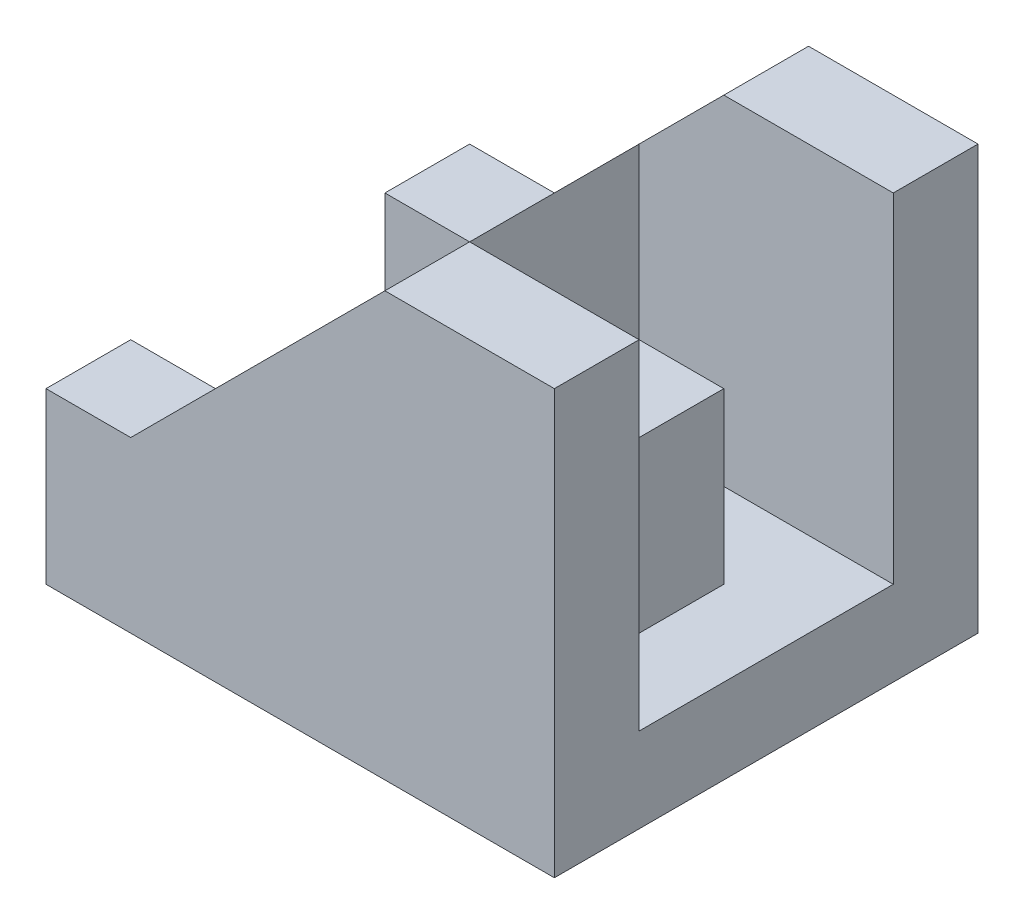
ISO-10303-21;
HEADER;
FILE_DESCRIPTION(('STEP AP214'),'2;1');
FILE_NAME('part.step','',(''),(''),'','','');
FILE_SCHEMA(('AUTOMOTIVE_DESIGN { 1 0 10303 214 1 1 1 1 }'));
ENDSEC;
DATA;
#1=APPLICATION_CONTEXT('core data for automotive mechanical design processes');
#2=APPLICATION_PROTOCOL_DEFINITION('international standard','automotive_design',2000,#1);
#3=PRODUCT_CONTEXT('',#1,'mechanical');
#4=PRODUCT('Part','Part','',(#3));
#5=PRODUCT_RELATED_PRODUCT_CATEGORY('part','',(#4));
#6=PRODUCT_DEFINITION_FORMATION('','',#4);
#7=PRODUCT_DEFINITION_CONTEXT('part definition',#1,'design');
#8=PRODUCT_DEFINITION('design','',#6,#7);
#9=PRODUCT_DEFINITION_SHAPE('','',#8);
#10=(LENGTH_UNIT() NAMED_UNIT(*) SI_UNIT(.MILLI.,.METRE.));
#11=(NAMED_UNIT(*) PLANE_ANGLE_UNIT() SI_UNIT($,.RADIAN.));
#12=(NAMED_UNIT(*) SI_UNIT($,.STERADIAN.) SOLID_ANGLE_UNIT());
#13=UNCERTAINTY_MEASURE_WITH_UNIT(LENGTH_MEASURE(1.E-05),#10,'distance_accuracy_value','');
#14=(GEOMETRIC_REPRESENTATION_CONTEXT(3) GLOBAL_UNCERTAINTY_ASSIGNED_CONTEXT((#13)) GLOBAL_UNIT_ASSIGNED_CONTEXT((#10,
#11,#12)) REPRESENTATION_CONTEXT('',''));
#15=CARTESIAN_POINT('',(0.,0.,0.));
#16=DIRECTION('',(0.,0.,1.));
#17=DIRECTION('',(1.,0.,0.));
#18=AXIS2_PLACEMENT_3D('',#15,#16,#17);
#19=CARTESIAN_POINT('',(20.,25.,25.));
#20=DIRECTION('',(0.707106781186548,-0.707106781186547,0.));
#21=DIRECTION('',(0.707106781186547,0.707106781186548,0.));
#22=AXIS2_PLACEMENT_3D('',#19,#20,#21);
#23=PLANE('',#22);
#24=DIRECTION('',(0.,0.,-1.));
#25=VECTOR('',#24,1.);
#26=CARTESIAN_POINT('',(15.,20.,25.));
#27=LINE('',#26,#25);
#28=CARTESIAN_POINT('',(15.,20.,20.));
#29=VERTEX_POINT('',#28);
#30=CARTESIAN_POINT('',(15.,20.,5.));
#31=VERTEX_POINT('',#30);
#32=EDGE_CURVE('E275',#29,#31,#27,.T.);
#33=ORIENTED_EDGE('',*,*,#32,.T.);
#34=DIRECTION('',(0.707106781186547,0.707106781186548,0.));
#35=VECTOR('',#34,1.);
#36=CARTESIAN_POINT('',(20.,25.,5.));
#37=LINE('',#36,#35);
#38=CARTESIAN_POINT('',(20.,25.,5.));
#39=VERTEX_POINT('',#38);
#40=EDGE_CURVE('E11',#31,#39,#37,.T.);
#41=ORIENTED_EDGE('',*,*,#40,.T.);
#42=DIRECTION('',(0.,0.,-1.));
#43=VECTOR('',#42,1.);
#44=CARTESIAN_POINT('',(20.,25.,25.));
#45=LINE('',#44,#43);
#46=CARTESIAN_POINT('',(20.,25.,0.));
#47=VERTEX_POINT('',#46);
#48=EDGE_CURVE('E260',#39,#47,#45,.T.);
#49=ORIENTED_EDGE('',*,*,#48,.T.);
#50=DIRECTION('',(-0.707106781186547,-0.707106781186548,0.));
#51=VECTOR('',#50,1.);
#52=CARTESIAN_POINT('',(20.,25.,0.));
#53=LINE('',#52,#51);
#54=CARTESIAN_POINT('',(5.,10.,0.));
#55=VERTEX_POINT('',#54);
#56=EDGE_CURVE('E248',#47,#55,#53,.T.);
#57=ORIENTED_EDGE('',*,*,#56,.T.);
#58=DIRECTION('',(0.,0.,-1.));
#59=VECTOR('',#58,1.);
#60=CARTESIAN_POINT('',(5.,10.,25.));
#61=LINE('',#60,#59);
#62=CARTESIAN_POINT('',(5.,10.,5.));
#63=VERTEX_POINT('',#62);
#64=EDGE_CURVE('E256',#63,#55,#61,.T.);
#65=ORIENTED_EDGE('',*,*,#64,.F.);
#66=DIRECTION('',(0.,0.,-1.));
#67=VECTOR('',#66,1.);
#68=CARTESIAN_POINT('',(5.,10.,5.));
#69=LINE('',#68,#67);
#70=CARTESIAN_POINT('',(5.,10.,20.));
#71=VERTEX_POINT('',#70);
#72=EDGE_CURVE('E199',#71,#63,#69,.T.);
#73=ORIENTED_EDGE('',*,*,#72,.F.);
#74=CARTESIAN_POINT('',(5.,10.,25.));
#75=VERTEX_POINT('',#74);
#76=EDGE_CURVE('E257',#75,#71,#61,.T.);
#77=ORIENTED_EDGE('',*,*,#76,.F.);
#78=DIRECTION('',(-0.707106781186547,-0.707106781186548,0.));
#79=VECTOR('',#78,1.);
#80=CARTESIAN_POINT('',(20.,25.,25.));
#81=LINE('',#80,#79);
#82=CARTESIAN_POINT('',(20.,25.,25.));
#83=VERTEX_POINT('',#82);
#84=EDGE_CURVE('E233',#83,#75,#81,.T.);
#85=ORIENTED_EDGE('',*,*,#84,.F.);
#86=CARTESIAN_POINT('',(20.,25.,20.));
#87=VERTEX_POINT('',#86);
#88=EDGE_CURVE('E261',#83,#87,#45,.T.);
#89=ORIENTED_EDGE('',*,*,#88,.T.);
#90=DIRECTION('',(0.707106781186547,0.707106781186548,0.));
#91=VECTOR('',#90,1.);
#92=CARTESIAN_POINT('',(20.,25.,20.));
#93=LINE('',#92,#91);
#94=EDGE_CURVE('E41',#29,#87,#93,.T.);
#95=ORIENTED_EDGE('',*,*,#94,.F.);
#96=EDGE_LOOP('',(#33,#41,#49,#57,#65,#73,#77,#85,#89,#95));
#97=FACE_BOUND('',#96,.T.);
#98=ADVANCED_FACE('F33',(#97),#23,.F.);
#99=CARTESIAN_POINT('',(30.,25.,25.));
#100=DIRECTION('',(0.,-1.,0.));
#101=DIRECTION('',(1.,0.,0.));
#102=AXIS2_PLACEMENT_3D('',#99,#100,#101);
#103=PLANE('',#102);
#104=DIRECTION('',(-1.,0.,0.));
#105=VECTOR('',#104,1.);
#106=CARTESIAN_POINT('',(0.,25.,20.));
#107=LINE('',#106,#105);
#108=CARTESIAN_POINT('',(30.,25.,20.));
#109=VERTEX_POINT('',#108);
#110=EDGE_CURVE('E280',#109,#87,#107,.T.);
#111=ORIENTED_EDGE('',*,*,#110,.T.);
#112=ORIENTED_EDGE('',*,*,#88,.F.);
#113=DIRECTION('',(-1.,0.,0.));
#114=VECTOR('',#113,1.);
#115=CARTESIAN_POINT('',(30.,25.,25.));
#116=LINE('',#115,#114);
#117=CARTESIAN_POINT('',(30.,25.,25.));
#118=VERTEX_POINT('',#117);
#119=EDGE_CURVE('E231',#118,#83,#116,.T.);
#120=ORIENTED_EDGE('',*,*,#119,.F.);
#121=DIRECTION('',(0.,0.,-1.));
#122=VECTOR('',#121,1.);
#123=CARTESIAN_POINT('',(30.,25.,25.));
#124=LINE('',#123,#122);
#125=EDGE_CURVE('E265',#118,#109,#124,.T.);
#126=ORIENTED_EDGE('',*,*,#125,.T.);
#127=EDGE_LOOP('',(#111,#112,#120,#126));
#128=FACE_BOUND('',#127,.T.);
#129=ADVANCED_FACE('F285',(#128),#103,.F.);
#130=ORIENTED_EDGE('',*,*,#48,.F.);
#131=DIRECTION('',(-1.,0.,0.));
#132=VECTOR('',#131,1.);
#133=CARTESIAN_POINT('',(0.,25.,5.00000000000001));
#134=LINE('',#133,#132);
#135=CARTESIAN_POINT('',(30.,25.,5.));
#136=VERTEX_POINT('',#135);
#137=EDGE_CURVE('E289',#136,#39,#134,.T.);
#138=ORIENTED_EDGE('',*,*,#137,.F.);
#139=CARTESIAN_POINT('',(30.,25.,0.));
#140=VERTEX_POINT('',#139);
#141=EDGE_CURVE('E264',#136,#140,#124,.T.);
#142=ORIENTED_EDGE('',*,*,#141,.T.);
#143=DIRECTION('',(-1.,0.,0.));
#144=VECTOR('',#143,1.);
#145=CARTESIAN_POINT('',(30.,25.,0.));
#146=LINE('',#145,#144);
#147=EDGE_CURVE('E245',#140,#47,#146,.T.);
#148=ORIENTED_EDGE('',*,*,#147,.T.);
#149=EDGE_LOOP('',(#130,#138,#142,#148));
#150=FACE_BOUND('',#149,.T.);
#151=ADVANCED_FACE('F348',(#150),#103,.F.);
#152=CARTESIAN_POINT('',(0.,10.,25.));
#153=DIRECTION('',(1.,0.,0.));
#154=DIRECTION('',(0.,0.,-1.));
#155=AXIS2_PLACEMENT_3D('',#152,#153,#154);
#156=PLANE('',#155);
#157=DIRECTION('',(0.,0.,-1.));
#158=VECTOR('',#157,1.);
#159=CARTESIAN_POINT('',(0.,0.,25.));
#160=LINE('',#159,#158);
#161=CARTESIAN_POINT('',(0.,0.,5.));
#162=VERTEX_POINT('',#161);
#163=CARTESIAN_POINT('',(0.,0.,0.));
#164=VERTEX_POINT('',#163);
#165=EDGE_CURVE('E271',#162,#164,#160,.T.);
#166=ORIENTED_EDGE('',*,*,#165,.F.);
#167=DIRECTION('',(0.,1.,0.));
#168=VECTOR('',#167,1.);
#169=CARTESIAN_POINT('',(0.,-15.,5.));
#170=LINE('',#169,#168);
#171=CARTESIAN_POINT('',(0.,10.,5.));
#172=VERTEX_POINT('',#171);
#173=EDGE_CURVE('E205',#162,#172,#170,.T.);
#174=ORIENTED_EDGE('',*,*,#173,.T.);
#175=DIRECTION('',(0.,0.,-1.));
#176=VECTOR('',#175,1.);
#177=CARTESIAN_POINT('',(0.,10.,25.));
#178=LINE('',#177,#176);
#179=CARTESIAN_POINT('',(0.,10.,0.));
#180=VERTEX_POINT('',#179);
#181=EDGE_CURVE('E237',#172,#180,#178,.T.);
#182=ORIENTED_EDGE('',*,*,#181,.T.);
#183=DIRECTION('',(0.,-1.,0.));
#184=VECTOR('',#183,1.);
#185=CARTESIAN_POINT('',(0.,10.,0.));
#186=LINE('',#185,#184);
#187=EDGE_CURVE('E222',#180,#164,#186,.T.);
#188=ORIENTED_EDGE('',*,*,#187,.T.);
#189=EDGE_LOOP('',(#166,#174,#182,#188));
#190=FACE_BOUND('',#189,.T.);
#191=ADVANCED_FACE('F366',(#190),#156,.F.);
#192=CARTESIAN_POINT('',(5.,10.,25.));
#193=DIRECTION('',(0.,-1.,0.));
#194=DIRECTION('',(0.,0.,-1.));
#195=AXIS2_PLACEMENT_3D('',#192,#193,#194);
#196=PLANE('',#195);
#197=ORIENTED_EDGE('',*,*,#181,.F.);
#198=DIRECTION('',(-1.,0.,0.));
#199=VECTOR('',#198,1.);
#200=CARTESIAN_POINT('',(0.,10.,5.));
#201=LINE('',#200,#199);
#202=EDGE_CURVE('E203',#63,#172,#201,.T.);
#203=ORIENTED_EDGE('',*,*,#202,.F.);
#204=ORIENTED_EDGE('',*,*,#64,.T.);
#205=DIRECTION('',(-1.,0.,0.));
#206=VECTOR('',#205,1.);
#207=CARTESIAN_POINT('',(5.,10.,0.));
#208=LINE('',#207,#206);
#209=EDGE_CURVE('E227',#55,#180,#208,.T.);
#210=ORIENTED_EDGE('',*,*,#209,.T.);
#211=EDGE_LOOP('',(#197,#203,#204,#210));
#212=FACE_BOUND('',#211,.T.);
#213=ADVANCED_FACE('F360',(#212),#196,.F.);
#214=CARTESIAN_POINT('',(0.,10.,25.));
#215=VERTEX_POINT('',#214);
#216=CARTESIAN_POINT('',(0.,10.,20.));
#217=VERTEX_POINT('',#216);
#218=EDGE_CURVE('E253',#215,#217,#178,.T.);
#219=ORIENTED_EDGE('',*,*,#218,.T.);
#220=DIRECTION('',(0.,1.,0.));
#221=VECTOR('',#220,1.);
#222=CARTESIAN_POINT('',(0.,-15.,20.));
#223=LINE('',#222,#221);
#224=CARTESIAN_POINT('',(0.,0.,20.));
#225=VERTEX_POINT('',#224);
#226=EDGE_CURVE('E56',#225,#217,#223,.T.);
#227=ORIENTED_EDGE('',*,*,#226,.F.);
#228=CARTESIAN_POINT('',(0.,0.,25.));
#229=VERTEX_POINT('',#228);
#230=EDGE_CURVE('E272',#229,#225,#160,.T.);
#231=ORIENTED_EDGE('',*,*,#230,.F.);
#232=DIRECTION('',(0.,-1.,0.));
#233=VECTOR('',#232,1.);
#234=CARTESIAN_POINT('',(0.,10.,25.));
#235=LINE('',#234,#233);
#236=EDGE_CURVE('E223',#215,#229,#235,.T.);
#237=ORIENTED_EDGE('',*,*,#236,.F.);
#238=EDGE_LOOP('',(#219,#227,#231,#237));
#239=FACE_BOUND('',#238,.T.);
#240=ADVANCED_FACE('F35',(#239),#156,.F.);
#241=CARTESIAN_POINT('',(0.,0.,25.));
#242=DIRECTION('',(0.,1.,0.));
#243=DIRECTION('',(0.,0.,1.));
#244=AXIS2_PLACEMENT_3D('',#241,#242,#243);
#245=PLANE('',#244);
#246=DIRECTION('',(0.,0.,-1.));
#247=VECTOR('',#246,1.);
#248=CARTESIAN_POINT('',(5.,0.,25.));
#249=LINE('',#248,#247);
#250=CARTESIAN_POINT('',(5.,0.,20.));
#251=VERTEX_POINT('',#250);
#252=CARTESIAN_POINT('',(5.,0.,5.));
#253=VERTEX_POINT('',#252);
#254=EDGE_CURVE('E216',#251,#253,#249,.T.);
#255=ORIENTED_EDGE('',*,*,#254,.T.);
#256=DIRECTION('',(-1.,0.,0.));
#257=VECTOR('',#256,1.);
#258=CARTESIAN_POINT('',(0.,0.,5.));
#259=LINE('',#258,#257);
#260=EDGE_CURVE('E219',#253,#162,#259,.T.);
#261=ORIENTED_EDGE('',*,*,#260,.T.);
#262=ORIENTED_EDGE('',*,*,#165,.T.);
#263=DIRECTION('',(1.,0.,0.));
#264=VECTOR('',#263,1.);
#265=CARTESIAN_POINT('',(0.,0.,0.));
#266=LINE('',#265,#264);
#267=CARTESIAN_POINT('',(30.,0.,0.));
#268=VERTEX_POINT('',#267);
#269=EDGE_CURVE('E240',#164,#268,#266,.T.);
#270=ORIENTED_EDGE('',*,*,#269,.T.);
#271=DIRECTION('',(0.,0.,-1.));
#272=VECTOR('',#271,1.);
#273=CARTESIAN_POINT('',(30.,0.,25.));
#274=LINE('',#273,#272);
#275=CARTESIAN_POINT('',(30.,0.,25.));
#276=VERTEX_POINT('',#275);
#277=EDGE_CURVE('E268',#276,#268,#274,.T.);
#278=ORIENTED_EDGE('',*,*,#277,.F.);
#279=DIRECTION('',(1.,0.,0.));
#280=VECTOR('',#279,1.);
#281=CARTESIAN_POINT('',(0.,0.,25.));
#282=LINE('',#281,#280);
#283=EDGE_CURVE('E226',#229,#276,#282,.T.);
#284=ORIENTED_EDGE('',*,*,#283,.F.);
#285=ORIENTED_EDGE('',*,*,#230,.T.);
#286=DIRECTION('',(1.,0.,0.));
#287=VECTOR('',#286,1.);
#288=CARTESIAN_POINT('',(0.,0.,20.));
#289=LINE('',#288,#287);
#290=EDGE_CURVE('E208',#225,#251,#289,.T.);
#291=ORIENTED_EDGE('',*,*,#290,.T.);
#292=EDGE_LOOP('',(#255,#261,#262,#270,#278,#284,#285,#291));
#293=FACE_BOUND('',#292,.T.);
#294=ADVANCED_FACE('F369',(#293),#245,.F.);
#295=CARTESIAN_POINT('',(30.,0.,25.));
#296=DIRECTION('',(-1.,0.,0.));
#297=DIRECTION('',(0.,0.,1.));
#298=AXIS2_PLACEMENT_3D('',#295,#296,#297);
#299=PLANE('',#298);
#300=ORIENTED_EDGE('',*,*,#141,.F.);
#301=DIRECTION('',(0.,1.,0.));
#302=VECTOR('',#301,1.);
#303=CARTESIAN_POINT('',(30.,5.00000000000001,5.));
#304=LINE('',#303,#302);
#305=CARTESIAN_POINT('',(30.,5.00000000000001,5.));
#306=VERTEX_POINT('',#305);
#307=EDGE_CURVE('E307',#306,#136,#304,.T.);
#308=ORIENTED_EDGE('',*,*,#307,.F.);
#309=DIRECTION('',(0.,0.,-1.));
#310=VECTOR('',#309,1.);
#311=CARTESIAN_POINT('',(30.,5.00000000000001,0.));
#312=LINE('',#311,#310);
#313=CARTESIAN_POINT('',(30.,5.00000000000001,20.));
#314=VERTEX_POINT('',#313);
#315=EDGE_CURVE('E305',#314,#306,#312,.T.);
#316=ORIENTED_EDGE('',*,*,#315,.F.);
#317=DIRECTION('',(0.,1.,0.));
#318=VECTOR('',#317,1.);
#319=CARTESIAN_POINT('',(30.,5.00000000000001,20.));
#320=LINE('',#319,#318);
#321=EDGE_CURVE('E188',#314,#109,#320,.T.);
#322=ORIENTED_EDGE('',*,*,#321,.T.);
#323=ORIENTED_EDGE('',*,*,#125,.F.);
#324=DIRECTION('',(0.,1.,0.));
#325=VECTOR('',#324,1.);
#326=CARTESIAN_POINT('',(30.,0.,25.));
#327=LINE('',#326,#325);
#328=EDGE_CURVE('E229',#276,#118,#327,.T.);
#329=ORIENTED_EDGE('',*,*,#328,.F.);
#330=ORIENTED_EDGE('',*,*,#277,.T.);
#331=DIRECTION('',(0.,1.,0.));
#332=VECTOR('',#331,1.);
#333=CARTESIAN_POINT('',(30.,0.,0.));
#334=LINE('',#333,#332);
#335=EDGE_CURVE('E242',#268,#140,#334,.T.);
#336=ORIENTED_EDGE('',*,*,#335,.T.);
#337=EDGE_LOOP('',(#300,#308,#316,#322,#323,#329,#330,#336));
#338=FACE_BOUND('',#337,.T.);
#339=ADVANCED_FACE('F301',(#338),#299,.F.);
#340=ORIENTED_EDGE('',*,*,#76,.T.);
#341=DIRECTION('',(1.,0.,0.));
#342=VECTOR('',#341,1.);
#343=CARTESIAN_POINT('',(0.,10.,20.));
#344=LINE('',#343,#342);
#345=EDGE_CURVE('E197',#217,#71,#344,.T.);
#346=ORIENTED_EDGE('',*,*,#345,.F.);
#347=ORIENTED_EDGE('',*,*,#218,.F.);
#348=DIRECTION('',(-1.,0.,0.));
#349=VECTOR('',#348,1.);
#350=CARTESIAN_POINT('',(5.,10.,25.));
#351=LINE('',#350,#349);
#352=EDGE_CURVE('E235',#75,#215,#351,.T.);
#353=ORIENTED_EDGE('',*,*,#352,.F.);
#354=EDGE_LOOP('',(#340,#346,#347,#353));
#355=FACE_BOUND('',#354,.T.);
#356=ADVANCED_FACE('F374',(#355),#196,.F.);
#357=CARTESIAN_POINT('',(0.,0.,25.));
#358=DIRECTION('',(0.,0.,1.));
#359=DIRECTION('',(1.,0.,0.));
#360=AXIS2_PLACEMENT_3D('',#357,#358,#359);
#361=PLANE('',#360);
#362=ORIENTED_EDGE('',*,*,#236,.T.);
#363=ORIENTED_EDGE('',*,*,#283,.T.);
#364=ORIENTED_EDGE('',*,*,#328,.T.);
#365=ORIENTED_EDGE('',*,*,#119,.T.);
#366=ORIENTED_EDGE('',*,*,#84,.T.);
#367=ORIENTED_EDGE('',*,*,#352,.T.);
#368=EDGE_LOOP('',(#362,#363,#364,#365,#366,#367));
#369=FACE_BOUND('',#368,.T.);
#370=ADVANCED_FACE('F295',(#369),#361,.T.);
#371=CARTESIAN_POINT('',(0.,0.,0.));
#372=DIRECTION('',(0.,0.,1.));
#373=DIRECTION('',(1.,0.,0.));
#374=AXIS2_PLACEMENT_3D('',#371,#372,#373);
#375=PLANE('',#374);
#376=ORIENTED_EDGE('',*,*,#187,.F.);
#377=ORIENTED_EDGE('',*,*,#209,.F.);
#378=ORIENTED_EDGE('',*,*,#56,.F.);
#379=ORIENTED_EDGE('',*,*,#147,.F.);
#380=ORIENTED_EDGE('',*,*,#335,.F.);
#381=ORIENTED_EDGE('',*,*,#269,.F.);
#382=EDGE_LOOP('',(#376,#377,#378,#379,#380,#381));
#383=FACE_BOUND('',#382,.T.);
#384=ADVANCED_FACE('F355',(#383),#375,.F.);
#385=CARTESIAN_POINT('',(0.,-15.,5.));
#386=DIRECTION('',(0.,0.,-1.));
#387=DIRECTION('',(-1.,0.,0.));
#388=AXIS2_PLACEMENT_3D('',#385,#386,#387);
#389=PLANE('',#388);
#390=DIRECTION('',(0.,1.,0.));
#391=VECTOR('',#390,1.);
#392=CARTESIAN_POINT('',(5.,-15.,5.));
#393=LINE('',#392,#391);
#394=EDGE_CURVE('E209',#253,#63,#393,.T.);
#395=ORIENTED_EDGE('',*,*,#394,.T.);
#396=ORIENTED_EDGE('',*,*,#202,.T.);
#397=ORIENTED_EDGE('',*,*,#173,.F.);
#398=ORIENTED_EDGE('',*,*,#260,.F.);
#399=EDGE_LOOP('',(#395,#396,#397,#398));
#400=FACE_BOUND('',#399,.T.);
#401=ADVANCED_FACE('F362',(#400),#389,.F.);
#402=CARTESIAN_POINT('',(5.,-15.,5.));
#403=DIRECTION('',(1.,0.,0.));
#404=DIRECTION('',(0.,0.,-1.));
#405=AXIS2_PLACEMENT_3D('',#402,#403,#404);
#406=PLANE('',#405);
#407=DIRECTION('',(0.,1.,0.));
#408=VECTOR('',#407,1.);
#409=CARTESIAN_POINT('',(5.,-15.,20.));
#410=LINE('',#409,#408);
#411=EDGE_CURVE('E211',#251,#71,#410,.T.);
#412=ORIENTED_EDGE('',*,*,#411,.T.);
#413=ORIENTED_EDGE('',*,*,#72,.T.);
#414=ORIENTED_EDGE('',*,*,#394,.F.);
#415=ORIENTED_EDGE('',*,*,#254,.F.);
#416=EDGE_LOOP('',(#412,#413,#414,#415));
#417=FACE_BOUND('',#416,.T.);
#418=ADVANCED_FACE('F378',(#417),#406,.F.);
#419=CARTESIAN_POINT('',(0.,-15.,20.));
#420=DIRECTION('',(0.,0.,1.));
#421=DIRECTION('',(1.,0.,0.));
#422=AXIS2_PLACEMENT_3D('',#419,#420,#421);
#423=PLANE('',#422);
#424=ORIENTED_EDGE('',*,*,#226,.T.);
#425=ORIENTED_EDGE('',*,*,#345,.T.);
#426=ORIENTED_EDGE('',*,*,#411,.F.);
#427=ORIENTED_EDGE('',*,*,#290,.F.);
#428=EDGE_LOOP('',(#424,#425,#426,#427));
#429=FACE_BOUND('',#428,.T.);
#430=ADVANCED_FACE('F376',(#429),#423,.F.);
#431=CARTESIAN_POINT('',(0.,5.,10.));
#432=DIRECTION('',(0.,0.,1.));
#433=DIRECTION('',(1.,0.,0.));
#434=AXIS2_PLACEMENT_3D('',#431,#432,#433);
#435=PLANE('',#434);
#436=DIRECTION('',(0.,1.,0.));
#437=VECTOR('',#436,1.);
#438=CARTESIAN_POINT('',(15.,5.,10.));
#439=LINE('',#438,#437);
#440=CARTESIAN_POINT('',(15.,5.,10.));
#441=VERTEX_POINT('',#440);
#442=CARTESIAN_POINT('',(15.,15.,10.));
#443=VERTEX_POINT('',#442);
#444=EDGE_CURVE('E200',#441,#443,#439,.T.);
#445=ORIENTED_EDGE('',*,*,#444,.T.);
#446=DIRECTION('',(1.,0.,0.));
#447=VECTOR('',#446,1.);
#448=CARTESIAN_POINT('',(15.,15.,10.));
#449=LINE('',#448,#447);
#450=CARTESIAN_POINT('',(25.,15.,10.));
#451=VERTEX_POINT('',#450);
#452=EDGE_CURVE('E166',#443,#451,#449,.T.);
#453=ORIENTED_EDGE('',*,*,#452,.T.);
#454=DIRECTION('',(0.,1.,0.));
#455=VECTOR('',#454,1.);
#456=CARTESIAN_POINT('',(25.,5.,10.));
#457=LINE('',#456,#455);
#458=CARTESIAN_POINT('',(25.,5.,10.));
#459=VERTEX_POINT('',#458);
#460=EDGE_CURVE('E190',#459,#451,#457,.T.);
#461=ORIENTED_EDGE('',*,*,#460,.F.);
#462=DIRECTION('',(1.,0.,0.));
#463=VECTOR('',#462,1.);
#464=CARTESIAN_POINT('',(0.,5.,10.));
#465=LINE('',#464,#463);
#466=EDGE_CURVE('E314',#441,#459,#465,.T.);
#467=ORIENTED_EDGE('',*,*,#466,.F.);
#468=EDGE_LOOP('',(#445,#453,#461,#467));
#469=FACE_BOUND('',#468,.T.);
#470=ADVANCED_FACE('F335',(#469),#435,.F.);
#471=CARTESIAN_POINT('',(15.,5.,0.));
#472=DIRECTION('',(-1.,0.,0.));
#473=DIRECTION('',(0.,-1.,0.));
#474=AXIS2_PLACEMENT_3D('',#471,#472,#473);
#475=PLANE('',#474);
#476=ORIENTED_EDGE('',*,*,#444,.F.);
#477=DIRECTION('',(0.,0.,1.));
#478=VECTOR('',#477,1.);
#479=CARTESIAN_POINT('',(15.,5.,0.));
#480=LINE('',#479,#478);
#481=CARTESIAN_POINT('',(15.,5.,5.));
#482=VERTEX_POINT('',#481);
#483=EDGE_CURVE('E196',#482,#441,#480,.T.);
#484=ORIENTED_EDGE('',*,*,#483,.F.);
#485=DIRECTION('',(0.,1.,0.));
#486=VECTOR('',#485,1.);
#487=CARTESIAN_POINT('',(15.,5.,5.));
#488=LINE('',#487,#486);
#489=EDGE_CURVE('E308',#482,#31,#488,.T.);
#490=ORIENTED_EDGE('',*,*,#489,.T.);
#491=ORIENTED_EDGE('',*,*,#32,.F.);
#492=DIRECTION('',(0.,1.,0.));
#493=VECTOR('',#492,1.);
#494=CARTESIAN_POINT('',(15.,5.,20.));
#495=LINE('',#494,#493);
#496=CARTESIAN_POINT('',(15.,5.,20.));
#497=VERTEX_POINT('',#496);
#498=EDGE_CURVE('E185',#497,#29,#495,.T.);
#499=ORIENTED_EDGE('',*,*,#498,.F.);
#500=DIRECTION('',(0.,0.,1.));
#501=VECTOR('',#500,1.);
#502=CARTESIAN_POINT('',(15.,5.,0.));
#503=LINE('',#502,#501);
#504=CARTESIAN_POINT('',(15.,5.,15.));
#505=VERTEX_POINT('',#504);
#506=EDGE_CURVE('E184',#505,#497,#503,.T.);
#507=ORIENTED_EDGE('',*,*,#506,.F.);
#508=DIRECTION('',(0.,1.,0.));
#509=VECTOR('',#508,1.);
#510=CARTESIAN_POINT('',(15.,5.,15.));
#511=LINE('',#510,#509);
#512=CARTESIAN_POINT('',(15.,15.,15.));
#513=VERTEX_POINT('',#512);
#514=EDGE_CURVE('E175',#505,#513,#511,.T.);
#515=ORIENTED_EDGE('',*,*,#514,.T.);
#516=DIRECTION('',(0.,0.,-1.));
#517=VECTOR('',#516,1.);
#518=CARTESIAN_POINT('',(15.,15.,15.));
#519=LINE('',#518,#517);
#520=EDGE_CURVE('E163',#513,#443,#519,.T.);
#521=ORIENTED_EDGE('',*,*,#520,.T.);
#522=EDGE_LOOP('',(#476,#484,#490,#491,#499,#507,#515,#521));
#523=FACE_BOUND('',#522,.T.);
#524=ADVANCED_FACE('F181',(#523),#475,.F.);
#525=CARTESIAN_POINT('',(0.,5.,5.00000000000001));
#526=DIRECTION('',(0.,0.,-1.));
#527=DIRECTION('',(-1.,0.,0.));
#528=AXIS2_PLACEMENT_3D('',#525,#526,#527);
#529=PLANE('',#528);
#530=ORIENTED_EDGE('',*,*,#489,.F.);
#531=DIRECTION('',(-1.,0.,0.));
#532=VECTOR('',#531,1.);
#533=CARTESIAN_POINT('',(0.,5.,5.00000000000001));
#534=LINE('',#533,#532);
#535=EDGE_CURVE('E318',#306,#482,#534,.T.);
#536=ORIENTED_EDGE('',*,*,#535,.F.);
#537=ORIENTED_EDGE('',*,*,#307,.T.);
#538=ORIENTED_EDGE('',*,*,#137,.T.);
#539=ORIENTED_EDGE('',*,*,#40,.F.);
#540=EDGE_LOOP('',(#530,#536,#537,#538,#539));
#541=FACE_BOUND('',#540,.T.);
#542=ADVANCED_FACE('F344',(#541),#529,.F.);
#543=CARTESIAN_POINT('',(0.,5.,20.));
#544=DIRECTION('',(0.,0.,-1.));
#545=DIRECTION('',(-1.,0.,0.));
#546=AXIS2_PLACEMENT_3D('',#543,#544,#545);
#547=PLANE('',#546);
#548=ORIENTED_EDGE('',*,*,#94,.T.);
#549=ORIENTED_EDGE('',*,*,#110,.F.);
#550=ORIENTED_EDGE('',*,*,#321,.F.);
#551=DIRECTION('',(-1.,0.,0.));
#552=VECTOR('',#551,1.);
#553=CARTESIAN_POINT('',(0.,5.,20.));
#554=LINE('',#553,#552);
#555=EDGE_CURVE('E322',#314,#497,#554,.T.);
#556=ORIENTED_EDGE('',*,*,#555,.T.);
#557=ORIENTED_EDGE('',*,*,#498,.T.);
#558=EDGE_LOOP('',(#548,#549,#550,#556,#557));
#559=FACE_BOUND('',#558,.T.);
#560=ADVANCED_FACE('F279',(#559),#547,.T.);
#561=CARTESIAN_POINT('',(0.,5.,15.));
#562=DIRECTION('',(0.,0.,1.));
#563=DIRECTION('',(1.,0.,0.));
#564=AXIS2_PLACEMENT_3D('',#561,#562,#563);
#565=PLANE('',#564);
#566=DIRECTION('',(1.,0.,0.));
#567=VECTOR('',#566,1.);
#568=CARTESIAN_POINT('',(15.,15.,15.));
#569=LINE('',#568,#567);
#570=CARTESIAN_POINT('',(25.,15.,15.));
#571=VERTEX_POINT('',#570);
#572=EDGE_CURVE('E48',#513,#571,#569,.T.);
#573=ORIENTED_EDGE('',*,*,#572,.F.);
#574=ORIENTED_EDGE('',*,*,#514,.F.);
#575=DIRECTION('',(1.,0.,0.));
#576=VECTOR('',#575,1.);
#577=CARTESIAN_POINT('',(0.,5.,15.));
#578=LINE('',#577,#576);
#579=CARTESIAN_POINT('',(25.,5.,15.));
#580=VERTEX_POINT('',#579);
#581=EDGE_CURVE('E325',#505,#580,#578,.T.);
#582=ORIENTED_EDGE('',*,*,#581,.T.);
#583=DIRECTION('',(0.,1.,0.));
#584=VECTOR('',#583,1.);
#585=CARTESIAN_POINT('',(25.,5.,15.));
#586=LINE('',#585,#584);
#587=EDGE_CURVE('E178',#580,#571,#586,.T.);
#588=ORIENTED_EDGE('',*,*,#587,.T.);
#589=EDGE_LOOP('',(#573,#574,#582,#588));
#590=FACE_BOUND('',#589,.T.);
#591=ADVANCED_FACE('F174',(#590),#565,.T.);
#592=CARTESIAN_POINT('',(25.,5.,0.));
#593=DIRECTION('',(-1.,0.,0.));
#594=DIRECTION('',(0.,0.,1.));
#595=AXIS2_PLACEMENT_3D('',#592,#593,#594);
#596=PLANE('',#595);
#597=ORIENTED_EDGE('',*,*,#460,.T.);
#598=DIRECTION('',(0.,0.,-1.));
#599=VECTOR('',#598,1.);
#600=CARTESIAN_POINT('',(25.,15.,15.));
#601=LINE('',#600,#599);
#602=EDGE_CURVE('E170',#571,#451,#601,.T.);
#603=ORIENTED_EDGE('',*,*,#602,.F.);
#604=ORIENTED_EDGE('',*,*,#587,.F.);
#605=DIRECTION('',(0.,0.,1.));
#606=VECTOR('',#605,1.);
#607=CARTESIAN_POINT('',(25.,5.,0.));
#608=LINE('',#607,#606);
#609=EDGE_CURVE('E327',#459,#580,#608,.T.);
#610=ORIENTED_EDGE('',*,*,#609,.F.);
#611=EDGE_LOOP('',(#597,#603,#604,#610));
#612=FACE_BOUND('',#611,.T.);
#613=ADVANCED_FACE('F338',(#612),#596,.F.);
#614=CARTESIAN_POINT('',(0.,5.,0.));
#615=DIRECTION('',(0.,1.,0.));
#616=DIRECTION('',(-1.,0.,0.));
#617=AXIS2_PLACEMENT_3D('',#614,#615,#616);
#618=PLANE('',#617);
#619=ORIENTED_EDGE('',*,*,#466,.T.);
#620=ORIENTED_EDGE('',*,*,#609,.T.);
#621=ORIENTED_EDGE('',*,*,#581,.F.);
#622=ORIENTED_EDGE('',*,*,#506,.T.);
#623=ORIENTED_EDGE('',*,*,#555,.F.);
#624=ORIENTED_EDGE('',*,*,#315,.T.);
#625=ORIENTED_EDGE('',*,*,#535,.T.);
#626=ORIENTED_EDGE('',*,*,#483,.T.);
#627=EDGE_LOOP('',(#619,#620,#621,#622,#623,#624,#625,#626));
#628=FACE_BOUND('',#627,.T.);
#629=ADVANCED_FACE('F340',(#628),#618,.T.);
#630=CARTESIAN_POINT('',(15.,15.,15.));
#631=DIRECTION('',(0.,-1.,0.));
#632=DIRECTION('',(1.,0.,0.));
#633=AXIS2_PLACEMENT_3D('',#630,#631,#632);
#634=PLANE('',#633);
#635=ORIENTED_EDGE('',*,*,#602,.T.);
#636=ORIENTED_EDGE('',*,*,#452,.F.);
#637=ORIENTED_EDGE('',*,*,#520,.F.);
#638=ORIENTED_EDGE('',*,*,#572,.T.);
#639=EDGE_LOOP('',(#635,#636,#637,#638));
#640=FACE_BOUND('',#639,.T.);
#641=ADVANCED_FACE('F164',(#640),#634,.F.);
#642=CLOSED_SHELL('',(#98,#129,#151,#191,#213,#240,#294,#339,#356,#370,#384,#401,#418,#430,#470,
#524,#542,#560,#591,#613,#629,#641));
#643=MANIFOLD_SOLID_BREP('B2',#642);
#644=ADVANCED_BREP_SHAPE_REPRESENTATION('',(#18,#643),#14);
#645=SHAPE_DEFINITION_REPRESENTATION(#9,#644);
ENDSEC;
END-ISO-10303-21;
